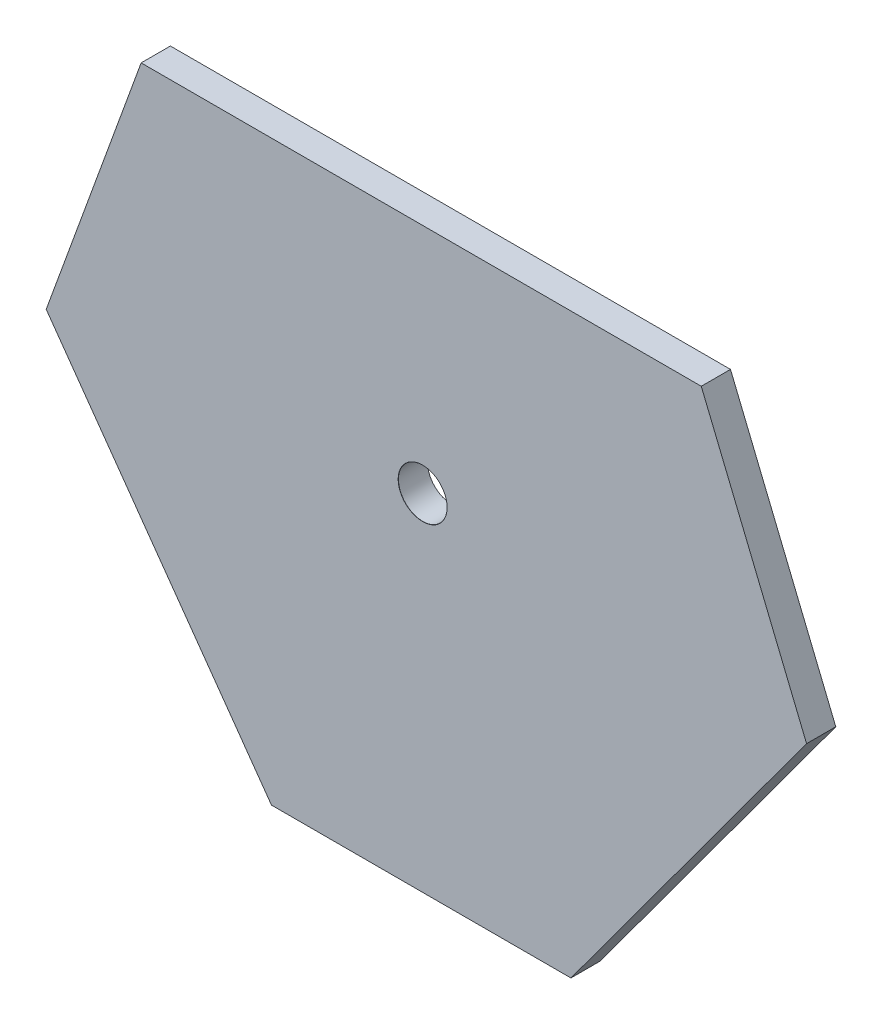
ISO-10303-21;
HEADER;
FILE_DESCRIPTION(('STEP AP214'),'2;1');
FILE_NAME('part.step','',(''),(''),'','','');
FILE_SCHEMA(('AUTOMOTIVE_DESIGN { 1 0 10303 214 1 1 1 1 }'));
ENDSEC;
DATA;
#1=APPLICATION_CONTEXT('core data for automotive mechanical design processes');
#2=APPLICATION_PROTOCOL_DEFINITION('international standard','automotive_design',2000,#1);
#3=PRODUCT_CONTEXT('',#1,'mechanical');
#4=PRODUCT('Part','Part','',(#3));
#5=PRODUCT_RELATED_PRODUCT_CATEGORY('part','',(#4));
#6=PRODUCT_DEFINITION_FORMATION('','',#4);
#7=PRODUCT_DEFINITION_CONTEXT('part definition',#1,'design');
#8=PRODUCT_DEFINITION('design','',#6,#7);
#9=PRODUCT_DEFINITION_SHAPE('','',#8);
#10=(LENGTH_UNIT() NAMED_UNIT(*) SI_UNIT(.MILLI.,.METRE.));
#11=(NAMED_UNIT(*) PLANE_ANGLE_UNIT() SI_UNIT($,.RADIAN.));
#12=(NAMED_UNIT(*) SI_UNIT($,.STERADIAN.) SOLID_ANGLE_UNIT());
#13=UNCERTAINTY_MEASURE_WITH_UNIT(LENGTH_MEASURE(1.E-05),#10,'distance_accuracy_value','');
#14=(GEOMETRIC_REPRESENTATION_CONTEXT(3) GLOBAL_UNCERTAINTY_ASSIGNED_CONTEXT((#13)) GLOBAL_UNIT_ASSIGNED_CONTEXT((#10,
#11,#12)) REPRESENTATION_CONTEXT('',''));
#15=CARTESIAN_POINT('',(0.,0.,0.));
#16=DIRECTION('',(0.,0.,1.));
#17=DIRECTION('',(1.,0.,0.));
#18=AXIS2_PLACEMENT_3D('',#15,#16,#17);
#19=CARTESIAN_POINT('',(-94.1822838812447,56.9570027670335,6.));
#20=DIRECTION('',(0.814919517605873,0.579574136608089,0.));
#21=DIRECTION('',(-0.579574136608089,0.814919517605873,0.));
#22=AXIS2_PLACEMENT_3D('',#19,#20,#21);
#23=PLANE('',#22);
#24=DIRECTION('',(0.579574136608089,-0.814919517605873,0.));
#25=VECTOR('',#24,1.);
#26=CARTESIAN_POINT('',(-94.1822838812447,56.9570027670335,0.));
#27=LINE('',#26,#25);
#28=CARTESIAN_POINT('',(-94.1822838812447,56.9570027670335,0.));
#29=VERTEX_POINT('',#28);
#30=CARTESIAN_POINT('',(-47.9271357116814,-8.08079076483645,0.));
#31=VERTEX_POINT('',#30);
#32=EDGE_CURVE('E122',#29,#31,#27,.T.);
#33=ORIENTED_EDGE('',*,*,#32,.T.);
#34=DIRECTION('',(0.,0.,-1.));
#35=VECTOR('',#34,1.);
#36=CARTESIAN_POINT('',(-47.9271357116814,-8.08079076483645,6.));
#37=LINE('',#36,#35);
#38=CARTESIAN_POINT('',(-47.9271357116814,-8.08079076483645,6.));
#39=VERTEX_POINT('',#38);
#40=EDGE_CURVE('E11',#39,#31,#37,.T.);
#41=ORIENTED_EDGE('',*,*,#40,.F.);
#42=DIRECTION('',(0.579574136608089,-0.814919517605873,0.));
#43=VECTOR('',#42,1.);
#44=CARTESIAN_POINT('',(-94.1822838812447,56.9570027670335,6.));
#45=LINE('',#44,#43);
#46=CARTESIAN_POINT('',(-94.1822838812447,56.9570027670335,6.));
#47=VERTEX_POINT('',#46);
#48=EDGE_CURVE('E132',#47,#39,#45,.T.);
#49=ORIENTED_EDGE('',*,*,#48,.F.);
#50=DIRECTION('',(0.,0.,-1.));
#51=VECTOR('',#50,1.);
#52=CARTESIAN_POINT('',(-94.1822838812447,56.9570027670335,6.));
#53=LINE('',#52,#51);
#54=EDGE_CURVE('E118',#47,#29,#53,.T.);
#55=ORIENTED_EDGE('',*,*,#54,.T.);
#56=EDGE_LOOP('',(#33,#41,#49,#55));
#57=FACE_BOUND('',#56,.T.);
#58=ADVANCED_FACE('F37',(#57),#23,.F.);
#59=CARTESIAN_POINT('',(-47.9271357116814,-8.08079076483645,6.));
#60=DIRECTION('',(0.,1.,0.));
#61=DIRECTION('',(0.,0.,1.));
#62=AXIS2_PLACEMENT_3D('',#59,#60,#61);
#63=PLANE('',#62);
#64=DIRECTION('',(1.,0.,0.));
#65=VECTOR('',#64,1.);
#66=CARTESIAN_POINT('',(-47.9271357116814,-8.08079076483645,0.));
#67=LINE('',#66,#65);
#68=CARTESIAN_POINT('',(13.5528642883186,-8.08079076483645,0.));
#69=VERTEX_POINT('',#68);
#70=EDGE_CURVE('E125',#31,#69,#67,.T.);
#71=ORIENTED_EDGE('',*,*,#70,.T.);
#72=DIRECTION('',(0.,0.,-1.));
#73=VECTOR('',#72,1.);
#74=CARTESIAN_POINT('',(13.5528642883186,-8.08079076483645,6.));
#75=LINE('',#74,#73);
#76=CARTESIAN_POINT('',(13.5528642883186,-8.08079076483645,6.));
#77=VERTEX_POINT('',#76);
#78=EDGE_CURVE('E46',#77,#69,#75,.T.);
#79=ORIENTED_EDGE('',*,*,#78,.F.);
#80=DIRECTION('',(1.,0.,0.));
#81=VECTOR('',#80,1.);
#82=CARTESIAN_POINT('',(-47.9271357116814,-8.08079076483645,6.));
#83=LINE('',#82,#81);
#84=EDGE_CURVE('E91',#39,#77,#83,.T.);
#85=ORIENTED_EDGE('',*,*,#84,.F.);
#86=ORIENTED_EDGE('',*,*,#40,.T.);
#87=EDGE_LOOP('',(#71,#79,#85,#86));
#88=FACE_BOUND('',#87,.T.);
#89=ADVANCED_FACE('F158',(#88),#63,.F.);
#90=CARTESIAN_POINT('',(13.5528642883186,-8.08079076483645,6.));
#91=DIRECTION('',(-0.805923318127162,0.59201993657216,0.));
#92=DIRECTION('',(-0.59201993657216,-0.805923318127162,0.));
#93=AXIS2_PLACEMENT_3D('',#90,#91,#92);
#94=PLANE('',#93);
#95=DIRECTION('',(0.59201993657216,0.805923318127162,0.));
#96=VECTOR('',#95,1.);
#97=CARTESIAN_POINT('',(13.5528642883186,-8.08079076483645,0.));
#98=LINE('',#97,#96);
#99=CARTESIAN_POINT('',(61.9322301140833,57.7785775208727,0.));
#100=VERTEX_POINT('',#99);
#101=EDGE_CURVE('E127',#69,#100,#98,.T.);
#102=ORIENTED_EDGE('',*,*,#101,.T.);
#103=DIRECTION('',(0.,0.,-1.));
#104=VECTOR('',#103,1.);
#105=CARTESIAN_POINT('',(61.9322301140833,57.7785775208727,6.));
#106=LINE('',#105,#104);
#107=CARTESIAN_POINT('',(61.9322301140833,57.7785775208727,6.));
#108=VERTEX_POINT('',#107);
#109=EDGE_CURVE('E113',#108,#100,#106,.T.);
#110=ORIENTED_EDGE('',*,*,#109,.F.);
#111=DIRECTION('',(0.59201993657216,0.805923318127162,0.));
#112=VECTOR('',#111,1.);
#113=CARTESIAN_POINT('',(13.5528642883186,-8.08079076483645,6.));
#114=LINE('',#113,#112);
#115=EDGE_CURVE('E104',#77,#108,#114,.T.);
#116=ORIENTED_EDGE('',*,*,#115,.F.);
#117=ORIENTED_EDGE('',*,*,#78,.T.);
#118=EDGE_LOOP('',(#102,#110,#116,#117));
#119=FACE_BOUND('',#118,.T.);
#120=ADVANCED_FACE('F139',(#119),#94,.F.);
#121=CARTESIAN_POINT('',(40.3128642883186,110.51948215183,6.));
#122=DIRECTION('',(-0.925279028613291,-0.379287119750257,0.));
#123=DIRECTION('',(0.379287119750257,-0.925279028613291,0.));
#124=AXIS2_PLACEMENT_3D('',#121,#122,#123);
#125=PLANE('',#124);
#126=DIRECTION('',(-0.379287119750257,0.92527902861329,0.));
#127=VECTOR('',#126,1.);
#128=CARTESIAN_POINT('',(40.3128642883186,110.51948215183,0.));
#129=LINE('',#128,#127);
#130=CARTESIAN_POINT('',(40.3128642883186,110.51948215183,0.));
#131=VERTEX_POINT('',#130);
#132=EDGE_CURVE('E112',#100,#131,#129,.T.);
#133=ORIENTED_EDGE('',*,*,#132,.T.);
#134=DIRECTION('',(0.,0.,-1.));
#135=VECTOR('',#134,1.);
#136=CARTESIAN_POINT('',(40.3128642883186,110.51948215183,6.));
#137=LINE('',#136,#135);
#138=CARTESIAN_POINT('',(40.3128642883186,110.51948215183,6.));
#139=VERTEX_POINT('',#138);
#140=EDGE_CURVE('E109',#139,#131,#137,.T.);
#141=ORIENTED_EDGE('',*,*,#140,.F.);
#142=DIRECTION('',(-0.379287119750257,0.92527902861329,0.));
#143=VECTOR('',#142,1.);
#144=CARTESIAN_POINT('',(40.3128642883186,110.51948215183,6.));
#145=LINE('',#144,#143);
#146=EDGE_CURVE('E98',#108,#139,#145,.T.);
#147=ORIENTED_EDGE('',*,*,#146,.F.);
#148=ORIENTED_EDGE('',*,*,#109,.T.);
#149=EDGE_LOOP('',(#133,#141,#147,#148));
#150=FACE_BOUND('',#149,.T.);
#151=ADVANCED_FACE('F110',(#150),#125,.F.);
#152=CARTESIAN_POINT('',(-74.6871357116814,110.51948215183,6.));
#153=DIRECTION('',(0.,-1.,0.));
#154=DIRECTION('',(1.,0.,0.));
#155=AXIS2_PLACEMENT_3D('',#152,#153,#154);
#156=PLANE('',#155);
#157=DIRECTION('',(-1.,0.,0.));
#158=VECTOR('',#157,1.);
#159=CARTESIAN_POINT('',(-74.6871357116814,110.51948215183,0.));
#160=LINE('',#159,#158);
#161=CARTESIAN_POINT('',(-74.6871357116814,110.51948215183,0.));
#162=VERTEX_POINT('',#161);
#163=EDGE_CURVE('E77',#131,#162,#160,.T.);
#164=ORIENTED_EDGE('',*,*,#163,.T.);
#165=DIRECTION('',(0.,0.,-1.));
#166=VECTOR('',#165,1.);
#167=CARTESIAN_POINT('',(-74.6871357116814,110.51948215183,6.));
#168=LINE('',#167,#166);
#169=CARTESIAN_POINT('',(-74.6871357116814,110.51948215183,6.));
#170=VERTEX_POINT('',#169);
#171=EDGE_CURVE('E114',#170,#162,#168,.T.);
#172=ORIENTED_EDGE('',*,*,#171,.F.);
#173=DIRECTION('',(-1.,0.,0.));
#174=VECTOR('',#173,1.);
#175=CARTESIAN_POINT('',(-74.6871357116814,110.51948215183,6.));
#176=LINE('',#175,#174);
#177=EDGE_CURVE('E102',#139,#170,#176,.T.);
#178=ORIENTED_EDGE('',*,*,#177,.F.);
#179=ORIENTED_EDGE('',*,*,#140,.T.);
#180=EDGE_LOOP('',(#164,#172,#178,#179));
#181=FACE_BOUND('',#180,.T.);
#182=ADVANCED_FACE('F116',(#181),#156,.F.);
#183=CARTESIAN_POINT('',(-74.6871357116814,110.51948215183,6.));
#184=DIRECTION('',(0.939692620785907,-0.342020143325672,0.));
#185=DIRECTION('',(0.342020143325672,0.939692620785907,0.));
#186=AXIS2_PLACEMENT_3D('',#183,#184,#185);
#187=PLANE('',#186);
#188=DIRECTION('',(-0.342020143325672,-0.939692620785907,0.));
#189=VECTOR('',#188,1.);
#190=CARTESIAN_POINT('',(-74.6871357116814,110.51948215183,0.));
#191=LINE('',#190,#189);
#192=EDGE_CURVE('E83',#162,#29,#191,.T.);
#193=ORIENTED_EDGE('',*,*,#192,.T.);
#194=ORIENTED_EDGE('',*,*,#54,.F.);
#195=DIRECTION('',(-0.342020143325672,-0.939692620785907,0.));
#196=VECTOR('',#195,1.);
#197=CARTESIAN_POINT('',(-74.6871357116814,110.51948215183,6.));
#198=LINE('',#197,#196);
#199=EDGE_CURVE('E54',#170,#47,#198,.T.);
#200=ORIENTED_EDGE('',*,*,#199,.F.);
#201=ORIENTED_EDGE('',*,*,#171,.T.);
#202=EDGE_LOOP('',(#193,#194,#200,#201));
#203=FACE_BOUND('',#202,.T.);
#204=ADVANCED_FACE('F146',(#203),#187,.F.);
#205=CARTESIAN_POINT('',(0.,0.,6.));
#206=DIRECTION('',(0.,0.,1.));
#207=DIRECTION('',(1.,0.,0.));
#208=AXIS2_PLACEMENT_3D('',#205,#206,#207);
#209=PLANE('',#208);
#210=CARTESIAN_POINT('',(-16.8906046882791,62.8731411650171,6.));
#211=DIRECTION('',(0.,0.,1.));
#212=DIRECTION('',(1.,0.,0.));
#213=AXIS2_PLACEMENT_3D('',#210,#211,#212);
#214=CIRCLE('',#213,5.025);
#215=CARTESIAN_POINT('',(-11.8656046882791,62.8731411650171,6.));
#216=VERTEX_POINT('',#215);
#217=EDGE_CURVE('E224',#216,#216,#214,.T.);
#218=ORIENTED_EDGE('',*,*,#217,.F.);
#219=EDGE_LOOP('',(#218));
#220=FACE_BOUND('',#219,.T.);
#221=ORIENTED_EDGE('',*,*,#48,.T.);
#222=ORIENTED_EDGE('',*,*,#84,.T.);
#223=ORIENTED_EDGE('',*,*,#115,.T.);
#224=ORIENTED_EDGE('',*,*,#146,.T.);
#225=ORIENTED_EDGE('',*,*,#177,.T.);
#226=ORIENTED_EDGE('',*,*,#199,.T.);
#227=EDGE_LOOP('',(#221,#222,#223,#224,#225,#226));
#228=FACE_BOUND('',#227,.T.);
#229=ADVANCED_FACE('F100',(#220,#228),#209,.T.);
#230=CARTESIAN_POINT('',(0.,0.,0.));
#231=DIRECTION('',(0.,0.,1.));
#232=DIRECTION('',(1.,0.,0.));
#233=AXIS2_PLACEMENT_3D('',#230,#231,#232);
#234=PLANE('',#233);
#235=CARTESIAN_POINT('',(-16.8906046882791,62.8731411650171,0.));
#236=DIRECTION('',(0.,0.,1.));
#237=DIRECTION('',(1.,0.,0.));
#238=AXIS2_PLACEMENT_3D('',#235,#236,#237);
#239=CIRCLE('',#238,4.99999999999998);
#240=CARTESIAN_POINT('',(-11.8906046882791,62.8731411650171,0.));
#241=VERTEX_POINT('',#240);
#242=EDGE_CURVE('E40',#241,#241,#239,.T.);
#243=ORIENTED_EDGE('',*,*,#242,.T.);
#244=EDGE_LOOP('',(#243));
#245=FACE_BOUND('',#244,.T.);
#246=ORIENTED_EDGE('',*,*,#32,.F.);
#247=ORIENTED_EDGE('',*,*,#192,.F.);
#248=ORIENTED_EDGE('',*,*,#163,.F.);
#249=ORIENTED_EDGE('',*,*,#132,.F.);
#250=ORIENTED_EDGE('',*,*,#101,.F.);
#251=ORIENTED_EDGE('',*,*,#70,.F.);
#252=EDGE_LOOP('',(#246,#247,#248,#249,#250,#251));
#253=FACE_BOUND('',#252,.T.);
#254=ADVANCED_FACE('F142',(#245,#253),#234,.F.);
#255=CARTESIAN_POINT('',(-16.8906046882791,62.8731411650171,6.));
#256=DIRECTION('',(0.,0.,1.));
#257=DIRECTION('',(1.,0.,0.));
#258=AXIS2_PLACEMENT_3D('',#255,#256,#257);
#259=CYLINDRICAL_SURFACE('',#258,4.99999999999998);
#260=CARTESIAN_POINT('',(-16.8906046882791,62.8731411650171,5.97499999999999));
#261=DIRECTION('',(0.,0.,1.));
#262=DIRECTION('',(1.,0.,0.));
#263=AXIS2_PLACEMENT_3D('',#260,#261,#262);
#264=CIRCLE('',#263,4.99999999999999);
#265=CARTESIAN_POINT('',(-11.8906046882791,62.8731411650171,5.97499999999999));
#266=VERTEX_POINT('',#265);
#267=EDGE_CURVE('E221',#266,#266,#264,.T.);
#268=ORIENTED_EDGE('',*,*,#267,.T.);
#269=EDGE_LOOP('',(#268));
#270=FACE_BOUND('',#269,.T.);
#271=ORIENTED_EDGE('',*,*,#242,.F.);
#272=EDGE_LOOP('',(#271));
#273=FACE_BOUND('',#272,.T.);
#274=ADVANCED_FACE('F195',(#270,#273),#259,.F.);
#275=CARTESIAN_POINT('',(-16.8906046882791,62.8731411650171,6.));
#276=DIRECTION('',(0.,0.,1.));
#277=DIRECTION('',(1.,0.,0.));
#278=AXIS2_PLACEMENT_3D('',#275,#276,#277);
#279=CONICAL_SURFACE('',#278,5.025,0.785398163397483);
#280=ORIENTED_EDGE('',*,*,#267,.F.);
#281=EDGE_LOOP('',(#280));
#282=FACE_BOUND('',#281,.T.);
#283=ORIENTED_EDGE('',*,*,#217,.T.);
#284=EDGE_LOOP('',(#283));
#285=FACE_BOUND('',#284,.T.);
#286=ADVANCED_FACE('F204',(#282,#285),#279,.F.);
#287=CLOSED_SHELL('',(#58,#89,#120,#151,#182,#204,#229,#254,#274,#286));
#288=MANIFOLD_SOLID_BREP('B2',#287);
#289=ADVANCED_BREP_SHAPE_REPRESENTATION('',(#18,#288),#14);
#290=SHAPE_DEFINITION_REPRESENTATION(#9,#289);
ENDSEC;
END-ISO-10303-21;
